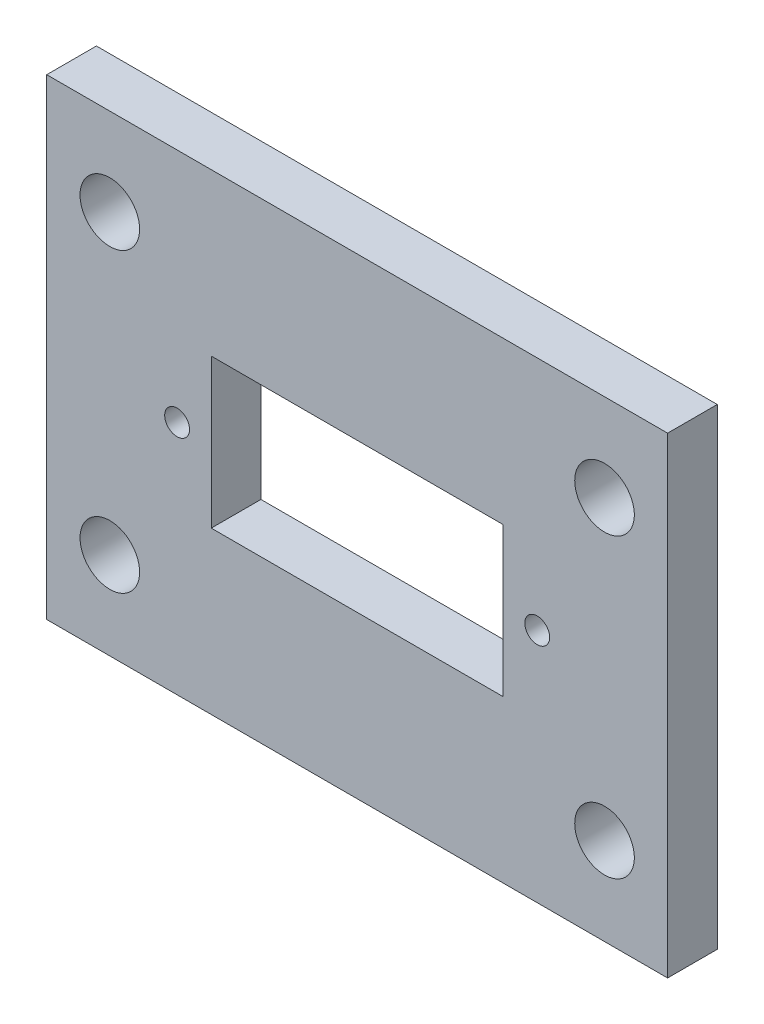
ISO-10303-21;
HEADER;
FILE_DESCRIPTION(('STEP AP214'),'2;1');
FILE_NAME('part.step','',(''),(''),'','','');
FILE_SCHEMA(('AUTOMOTIVE_DESIGN { 1 0 10303 214 1 1 1 1 }'));
ENDSEC;
DATA;
#1=APPLICATION_CONTEXT('core data for automotive mechanical design processes');
#2=APPLICATION_PROTOCOL_DEFINITION('international standard','automotive_design',2000,#1);
#3=PRODUCT_CONTEXT('',#1,'mechanical');
#4=PRODUCT('Part','Part','',(#3));
#5=PRODUCT_RELATED_PRODUCT_CATEGORY('part','',(#4));
#6=PRODUCT_DEFINITION_FORMATION('','',#4);
#7=PRODUCT_DEFINITION_CONTEXT('part definition',#1,'design');
#8=PRODUCT_DEFINITION('design','',#6,#7);
#9=PRODUCT_DEFINITION_SHAPE('','',#8);
#10=(LENGTH_UNIT() NAMED_UNIT(*) SI_UNIT(.MILLI.,.METRE.));
#11=(NAMED_UNIT(*) PLANE_ANGLE_UNIT() SI_UNIT($,.RADIAN.));
#12=(NAMED_UNIT(*) SI_UNIT($,.STERADIAN.) SOLID_ANGLE_UNIT());
#13=UNCERTAINTY_MEASURE_WITH_UNIT(LENGTH_MEASURE(1.E-05),#10,'distance_accuracy_value','');
#14=(GEOMETRIC_REPRESENTATION_CONTEXT(3) GLOBAL_UNCERTAINTY_ASSIGNED_CONTEXT((#13)) GLOBAL_UNIT_ASSIGNED_CONTEXT((#10,
#11,#12)) REPRESENTATION_CONTEXT('',''));
#15=CARTESIAN_POINT('',(0.,0.,0.));
#16=DIRECTION('',(0.,0.,1.));
#17=DIRECTION('',(1.,0.,0.));
#18=AXIS2_PLACEMENT_3D('',#15,#16,#17);
#19=CARTESIAN_POINT('',(0.,0.,4.));
#20=DIRECTION('',(0.,0.,1.));
#21=DIRECTION('',(1.,0.,0.));
#22=AXIS2_PLACEMENT_3D('',#19,#20,#21);
#23=PLANE('',#22);
#24=CARTESIAN_POINT('',(14.5,-19.,4.));
#25=DIRECTION('',(0.,0.,1.));
#26=DIRECTION('',(1.,0.,0.));
#27=AXIS2_PLACEMENT_3D('',#24,#25,#26);
#28=CIRCLE('',#27,1.);
#29=CARTESIAN_POINT('',(15.5,-19.,4.));
#30=VERTEX_POINT('',#29);
#31=EDGE_CURVE('E423',#30,#30,#28,.T.);
#32=ORIENTED_EDGE('',*,*,#31,.F.);
#33=EDGE_LOOP('',(#32));
#34=FACE_BOUND('',#33,.T.);
#35=CARTESIAN_POINT('',(-14.5,-19.,4.));
#36=DIRECTION('',(0.,0.,1.));
#37=DIRECTION('',(1.,0.,0.));
#38=AXIS2_PLACEMENT_3D('',#35,#36,#37);
#39=CIRCLE('',#38,1.);
#40=CARTESIAN_POINT('',(-13.5,-19.,4.));
#41=VERTEX_POINT('',#40);
#42=EDGE_CURVE('E427',#41,#41,#39,.T.);
#43=ORIENTED_EDGE('',*,*,#42,.F.);
#44=EDGE_LOOP('',(#43));
#45=FACE_BOUND('',#44,.T.);
#46=CARTESIAN_POINT('',(19.92,-30.955,4.));
#47=DIRECTION('',(0.,0.,-1.));
#48=DIRECTION('',(-1.,0.,0.));
#49=AXIS2_PLACEMENT_3D('',#46,#47,#48);
#50=CIRCLE('',#49,2.4);
#51=CARTESIAN_POINT('',(17.52,-30.955,4.));
#52=VERTEX_POINT('',#51);
#53=EDGE_CURVE('E437',#52,#52,#50,.T.);
#54=ORIENTED_EDGE('',*,*,#53,.T.);
#55=EDGE_LOOP('',(#54));
#56=FACE_BOUND('',#55,.T.);
#57=CARTESIAN_POINT('',(19.92,-7.045,4.));
#58=DIRECTION('',(0.,0.,-1.));
#59=DIRECTION('',(-1.,0.,0.));
#60=AXIS2_PLACEMENT_3D('',#57,#58,#59);
#61=CIRCLE('',#60,2.4);
#62=CARTESIAN_POINT('',(17.52,-7.045,4.));
#63=VERTEX_POINT('',#62);
#64=EDGE_CURVE('E208',#63,#63,#61,.T.);
#65=ORIENTED_EDGE('',*,*,#64,.T.);
#66=EDGE_LOOP('',(#65));
#67=FACE_BOUND('',#66,.T.);
#68=CARTESIAN_POINT('',(-19.92,-7.045,4.));
#69=DIRECTION('',(0.,0.,1.));
#70=DIRECTION('',(1.,0.,0.));
#71=AXIS2_PLACEMENT_3D('',#68,#69,#70);
#72=CIRCLE('',#71,2.4);
#73=CARTESIAN_POINT('',(-17.52,-7.045,4.));
#74=VERTEX_POINT('',#73);
#75=EDGE_CURVE('E225',#74,#74,#72,.T.);
#76=ORIENTED_EDGE('',*,*,#75,.F.);
#77=EDGE_LOOP('',(#76));
#78=FACE_BOUND('',#77,.T.);
#79=DIRECTION('',(0.,-1.,0.));
#80=VECTOR('',#79,1.);
#81=CARTESIAN_POINT('',(-25.,0.,4.));
#82=LINE('',#81,#80);
#83=CARTESIAN_POINT('',(-25.,0.,4.));
#84=VERTEX_POINT('',#83);
#85=CARTESIAN_POINT('',(-25.,-38.,4.));
#86=VERTEX_POINT('',#85);
#87=EDGE_CURVE('E231',#84,#86,#82,.T.);
#88=ORIENTED_EDGE('',*,*,#87,.T.);
#89=DIRECTION('',(1.,0.,0.));
#90=VECTOR('',#89,1.);
#91=CARTESIAN_POINT('',(-25.,-38.,4.));
#92=LINE('',#91,#90);
#93=CARTESIAN_POINT('',(25.,-38.,4.));
#94=VERTEX_POINT('',#93);
#95=EDGE_CURVE('E234',#86,#94,#92,.T.);
#96=ORIENTED_EDGE('',*,*,#95,.T.);
#97=DIRECTION('',(0.,-1.,0.));
#98=VECTOR('',#97,1.);
#99=CARTESIAN_POINT('',(25.,0.,4.));
#100=LINE('',#99,#98);
#101=CARTESIAN_POINT('',(25.,0.,4.));
#102=VERTEX_POINT('',#101);
#103=EDGE_CURVE('E237',#102,#94,#100,.T.);
#104=ORIENTED_EDGE('',*,*,#103,.F.);
#105=DIRECTION('',(1.,0.,0.));
#106=VECTOR('',#105,1.);
#107=CARTESIAN_POINT('',(-25.,0.,4.));
#108=LINE('',#107,#106);
#109=EDGE_CURVE('E240',#84,#102,#108,.T.);
#110=ORIENTED_EDGE('',*,*,#109,.F.);
#111=EDGE_LOOP('',(#88,#96,#104,#110));
#112=FACE_BOUND('',#111,.T.);
#113=CARTESIAN_POINT('',(-19.92,-30.955,4.));
#114=DIRECTION('',(0.,0.,1.));
#115=DIRECTION('',(1.,0.,0.));
#116=AXIS2_PLACEMENT_3D('',#113,#114,#115);
#117=CIRCLE('',#116,2.4);
#118=CARTESIAN_POINT('',(-17.52,-30.955,4.));
#119=VERTEX_POINT('',#118);
#120=EDGE_CURVE('E219',#119,#119,#117,.T.);
#121=ORIENTED_EDGE('',*,*,#120,.F.);
#122=EDGE_LOOP('',(#121));
#123=FACE_BOUND('',#122,.T.);
#124=DIRECTION('',(1.,0.,0.));
#125=VECTOR('',#124,1.);
#126=CARTESIAN_POINT('',(-11.75,-25.,4.));
#127=LINE('',#126,#125);
#128=CARTESIAN_POINT('',(-11.75,-25.,4.));
#129=VERTEX_POINT('',#128);
#130=CARTESIAN_POINT('',(11.75,-25.,4.));
#131=VERTEX_POINT('',#130);
#132=EDGE_CURVE('E191',#129,#131,#127,.T.);
#133=ORIENTED_EDGE('',*,*,#132,.F.);
#134=DIRECTION('',(0.,-1.,0.));
#135=VECTOR('',#134,1.);
#136=CARTESIAN_POINT('',(-11.75,-13.,4.));
#137=LINE('',#136,#135);
#138=CARTESIAN_POINT('',(-11.75,-13.,4.));
#139=VERTEX_POINT('',#138);
#140=EDGE_CURVE('E182',#139,#129,#137,.T.);
#141=ORIENTED_EDGE('',*,*,#140,.F.);
#142=DIRECTION('',(1.,0.,0.));
#143=VECTOR('',#142,1.);
#144=CARTESIAN_POINT('',(-11.75,-13.,4.));
#145=LINE('',#144,#143);
#146=CARTESIAN_POINT('',(11.75,-13.,4.));
#147=VERTEX_POINT('',#146);
#148=EDGE_CURVE('E202',#139,#147,#145,.T.);
#149=ORIENTED_EDGE('',*,*,#148,.T.);
#150=DIRECTION('',(0.,-1.,0.));
#151=VECTOR('',#150,1.);
#152=CARTESIAN_POINT('',(11.75,-13.,4.));
#153=LINE('',#152,#151);
#154=EDGE_CURVE('E132',#147,#131,#153,.T.);
#155=ORIENTED_EDGE('',*,*,#154,.T.);
#156=EDGE_LOOP('',(#133,#141,#149,#155));
#157=FACE_BOUND('',#156,.T.);
#158=ADVANCED_FACE('F117',(#34,#45,#56,#67,#78,#112,#123,#157),#23,.T.);
#159=CARTESIAN_POINT('',(0.,0.,0.));
#160=DIRECTION('',(0.,0.,1.));
#161=DIRECTION('',(1.,0.,0.));
#162=AXIS2_PLACEMENT_3D('',#159,#160,#161);
#163=PLANE('',#162);
#164=CARTESIAN_POINT('',(14.5,-19.,0.));
#165=DIRECTION('',(0.,0.,1.));
#166=DIRECTION('',(1.,0.,0.));
#167=AXIS2_PLACEMENT_3D('',#164,#165,#166);
#168=CIRCLE('',#167,1.);
#169=CARTESIAN_POINT('',(15.5,-19.,0.));
#170=VERTEX_POINT('',#169);
#171=EDGE_CURVE('E426',#170,#170,#168,.F.);
#172=ORIENTED_EDGE('',*,*,#171,.F.);
#173=EDGE_LOOP('',(#172));
#174=FACE_BOUND('',#173,.T.);
#175=CARTESIAN_POINT('',(-14.5,-19.,0.));
#176=DIRECTION('',(0.,0.,1.));
#177=DIRECTION('',(1.,0.,0.));
#178=AXIS2_PLACEMENT_3D('',#175,#176,#177);
#179=CIRCLE('',#178,1.);
#180=CARTESIAN_POINT('',(-13.5,-19.,0.));
#181=VERTEX_POINT('',#180);
#182=EDGE_CURVE('E430',#181,#181,#179,.F.);
#183=ORIENTED_EDGE('',*,*,#182,.F.);
#184=EDGE_LOOP('',(#183));
#185=FACE_BOUND('',#184,.T.);
#186=CARTESIAN_POINT('',(19.92,-30.955,0.));
#187=DIRECTION('',(0.,0.,-1.));
#188=DIRECTION('',(-1.,0.,0.));
#189=AXIS2_PLACEMENT_3D('',#186,#187,#188);
#190=CIRCLE('',#189,2.4);
#191=CARTESIAN_POINT('',(17.52,-30.955,0.));
#192=VERTEX_POINT('',#191);
#193=EDGE_CURVE('E436',#192,#192,#190,.T.);
#194=ORIENTED_EDGE('',*,*,#193,.F.);
#195=EDGE_LOOP('',(#194));
#196=FACE_BOUND('',#195,.T.);
#197=CARTESIAN_POINT('',(19.92,-7.045,0.));
#198=DIRECTION('',(0.,0.,-1.));
#199=DIRECTION('',(-1.,0.,0.));
#200=AXIS2_PLACEMENT_3D('',#197,#198,#199);
#201=CIRCLE('',#200,2.4);
#202=CARTESIAN_POINT('',(17.52,-7.045,0.));
#203=VERTEX_POINT('',#202);
#204=EDGE_CURVE('E440',#203,#203,#201,.T.);
#205=ORIENTED_EDGE('',*,*,#204,.F.);
#206=EDGE_LOOP('',(#205));
#207=FACE_BOUND('',#206,.T.);
#208=CARTESIAN_POINT('',(-19.92,-30.955,0.));
#209=DIRECTION('',(0.,0.,1.));
#210=DIRECTION('',(1.,0.,0.));
#211=AXIS2_PLACEMENT_3D('',#208,#209,#210);
#212=CIRCLE('',#211,2.4);
#213=CARTESIAN_POINT('',(-17.52,-30.955,0.));
#214=VERTEX_POINT('',#213);
#215=EDGE_CURVE('E198',#214,#214,#212,.T.);
#216=ORIENTED_EDGE('',*,*,#215,.T.);
#217=EDGE_LOOP('',(#216));
#218=FACE_BOUND('',#217,.T.);
#219=CARTESIAN_POINT('',(-19.92,-7.045,0.));
#220=DIRECTION('',(0.,0.,1.));
#221=DIRECTION('',(1.,0.,0.));
#222=AXIS2_PLACEMENT_3D('',#219,#220,#221);
#223=CIRCLE('',#222,2.4);
#224=CARTESIAN_POINT('',(-17.52,-7.045,0.));
#225=VERTEX_POINT('',#224);
#226=EDGE_CURVE('E222',#225,#225,#223,.T.);
#227=ORIENTED_EDGE('',*,*,#226,.T.);
#228=EDGE_LOOP('',(#227));
#229=FACE_BOUND('',#228,.T.);
#230=DIRECTION('',(0.,-1.,0.));
#231=VECTOR('',#230,1.);
#232=CARTESIAN_POINT('',(-25.,0.,0.));
#233=LINE('',#232,#231);
#234=CARTESIAN_POINT('',(-25.,0.,0.));
#235=VERTEX_POINT('',#234);
#236=CARTESIAN_POINT('',(-25.,-38.,0.));
#237=VERTEX_POINT('',#236);
#238=EDGE_CURVE('E228',#235,#237,#233,.T.);
#239=ORIENTED_EDGE('',*,*,#238,.F.);
#240=DIRECTION('',(1.,0.,0.));
#241=VECTOR('',#240,1.);
#242=CARTESIAN_POINT('',(-25.,0.,0.));
#243=LINE('',#242,#241);
#244=CARTESIAN_POINT('',(25.,0.,0.));
#245=VERTEX_POINT('',#244);
#246=EDGE_CURVE('E235',#235,#245,#243,.T.);
#247=ORIENTED_EDGE('',*,*,#246,.T.);
#248=DIRECTION('',(0.,-1.,0.));
#249=VECTOR('',#248,1.);
#250=CARTESIAN_POINT('',(25.,0.,0.));
#251=LINE('',#250,#249);
#252=CARTESIAN_POINT('',(25.,-38.,0.));
#253=VERTEX_POINT('',#252);
#254=EDGE_CURVE('E249',#245,#253,#251,.T.);
#255=ORIENTED_EDGE('',*,*,#254,.T.);
#256=DIRECTION('',(1.,0.,0.));
#257=VECTOR('',#256,1.);
#258=CARTESIAN_POINT('',(-25.,-38.,0.));
#259=LINE('',#258,#257);
#260=EDGE_CURVE('E246',#237,#253,#259,.T.);
#261=ORIENTED_EDGE('',*,*,#260,.F.);
#262=EDGE_LOOP('',(#239,#247,#255,#261));
#263=FACE_BOUND('',#262,.T.);
#264=DIRECTION('',(0.,-1.,0.));
#265=VECTOR('',#264,1.);
#266=CARTESIAN_POINT('',(-11.75,-13.,0.));
#267=LINE('',#266,#265);
#268=CARTESIAN_POINT('',(-11.75,-13.,0.));
#269=VERTEX_POINT('',#268);
#270=CARTESIAN_POINT('',(-11.75,-25.,0.));
#271=VERTEX_POINT('',#270);
#272=EDGE_CURVE('E140',#269,#271,#267,.T.);
#273=ORIENTED_EDGE('',*,*,#272,.T.);
#274=DIRECTION('',(1.,0.,0.));
#275=VECTOR('',#274,1.);
#276=CARTESIAN_POINT('',(-11.75,-25.,0.));
#277=LINE('',#276,#275);
#278=CARTESIAN_POINT('',(11.75,-25.,0.));
#279=VERTEX_POINT('',#278);
#280=EDGE_CURVE('E197',#271,#279,#277,.T.);
#281=ORIENTED_EDGE('',*,*,#280,.T.);
#282=DIRECTION('',(0.,-1.,0.));
#283=VECTOR('',#282,1.);
#284=CARTESIAN_POINT('',(11.75,-13.,0.));
#285=LINE('',#284,#283);
#286=CARTESIAN_POINT('',(11.75,-13.,0.));
#287=VERTEX_POINT('',#286);
#288=EDGE_CURVE('E210',#287,#279,#285,.T.);
#289=ORIENTED_EDGE('',*,*,#288,.F.);
#290=DIRECTION('',(1.,0.,0.));
#291=VECTOR('',#290,1.);
#292=CARTESIAN_POINT('',(-11.75,-13.,0.));
#293=LINE('',#292,#291);
#294=EDGE_CURVE('E192',#269,#287,#293,.T.);
#295=ORIENTED_EDGE('',*,*,#294,.F.);
#296=EDGE_LOOP('',(#273,#281,#289,#295));
#297=FACE_BOUND('',#296,.T.);
#298=ADVANCED_FACE('F266',(#174,#185,#196,#207,#218,#229,#263,#297),#163,.F.);
#299=CARTESIAN_POINT('',(-25.,0.,4.));
#300=DIRECTION('',(1.,0.,0.));
#301=DIRECTION('',(0.,1.,0.));
#302=AXIS2_PLACEMENT_3D('',#299,#300,#301);
#303=PLANE('',#302);
#304=ORIENTED_EDGE('',*,*,#238,.T.);
#305=DIRECTION('',(0.,0.,-1.));
#306=VECTOR('',#305,1.);
#307=CARTESIAN_POINT('',(-25.,-38.,4.));
#308=LINE('',#307,#306);
#309=EDGE_CURVE('E12',#86,#237,#308,.T.);
#310=ORIENTED_EDGE('',*,*,#309,.F.);
#311=ORIENTED_EDGE('',*,*,#87,.F.);
#312=DIRECTION('',(0.,0.,-1.));
#313=VECTOR('',#312,1.);
#314=CARTESIAN_POINT('',(-25.,0.,4.));
#315=LINE('',#314,#313);
#316=EDGE_CURVE('E243',#84,#235,#315,.T.);
#317=ORIENTED_EDGE('',*,*,#316,.T.);
#318=EDGE_LOOP('',(#304,#310,#311,#317));
#319=FACE_BOUND('',#318,.T.);
#320=ADVANCED_FACE('F119',(#319),#303,.F.);
#321=CARTESIAN_POINT('',(-25.,-38.,4.));
#322=DIRECTION('',(0.,1.,0.));
#323=DIRECTION('',(0.,0.,1.));
#324=AXIS2_PLACEMENT_3D('',#321,#322,#323);
#325=PLANE('',#324);
#326=ORIENTED_EDGE('',*,*,#260,.T.);
#327=DIRECTION('',(0.,0.,-1.));
#328=VECTOR('',#327,1.);
#329=CARTESIAN_POINT('',(25.,-38.,4.));
#330=LINE('',#329,#328);
#331=EDGE_CURVE('E125',#94,#253,#330,.T.);
#332=ORIENTED_EDGE('',*,*,#331,.F.);
#333=ORIENTED_EDGE('',*,*,#95,.F.);
#334=ORIENTED_EDGE('',*,*,#309,.T.);
#335=EDGE_LOOP('',(#326,#332,#333,#334));
#336=FACE_BOUND('',#335,.T.);
#337=ADVANCED_FACE('F262',(#336),#325,.F.);
#338=CARTESIAN_POINT('',(25.,0.,4.));
#339=DIRECTION('',(1.,0.,0.));
#340=DIRECTION('',(0.,0.,-1.));
#341=AXIS2_PLACEMENT_3D('',#338,#339,#340);
#342=PLANE('',#341);
#343=ORIENTED_EDGE('',*,*,#254,.F.);
#344=DIRECTION('',(0.,0.,-1.));
#345=VECTOR('',#344,1.);
#346=CARTESIAN_POINT('',(25.,0.,4.));
#347=LINE('',#346,#345);
#348=EDGE_CURVE('E255',#102,#245,#347,.T.);
#349=ORIENTED_EDGE('',*,*,#348,.F.);
#350=ORIENTED_EDGE('',*,*,#103,.T.);
#351=ORIENTED_EDGE('',*,*,#331,.T.);
#352=EDGE_LOOP('',(#343,#349,#350,#351));
#353=FACE_BOUND('',#352,.T.);
#354=ADVANCED_FACE('F259',(#353),#342,.T.);
#355=CARTESIAN_POINT('',(-25.,0.,4.));
#356=DIRECTION('',(0.,1.,0.));
#357=DIRECTION('',(-1.,0.,0.));
#358=AXIS2_PLACEMENT_3D('',#355,#356,#357);
#359=PLANE('',#358);
#360=ORIENTED_EDGE('',*,*,#246,.F.);
#361=ORIENTED_EDGE('',*,*,#316,.F.);
#362=ORIENTED_EDGE('',*,*,#109,.T.);
#363=ORIENTED_EDGE('',*,*,#348,.T.);
#364=EDGE_LOOP('',(#360,#361,#362,#363));
#365=FACE_BOUND('',#364,.T.);
#366=ADVANCED_FACE('F270',(#365),#359,.T.);
#367=CARTESIAN_POINT('',(-19.92,-7.045,4.));
#368=DIRECTION('',(0.,0.,-1.));
#369=DIRECTION('',(-1.,0.,0.));
#370=AXIS2_PLACEMENT_3D('',#367,#368,#369);
#371=CYLINDRICAL_SURFACE('',#370,2.4);
#372=ORIENTED_EDGE('',*,*,#75,.T.);
#373=EDGE_LOOP('',(#372));
#374=FACE_BOUND('',#373,.T.);
#375=ORIENTED_EDGE('',*,*,#226,.F.);
#376=EDGE_LOOP('',(#375));
#377=FACE_BOUND('',#376,.T.);
#378=ADVANCED_FACE('F291',(#374,#377),#371,.F.);
#379=CARTESIAN_POINT('',(-19.92,-30.955,4.));
#380=DIRECTION('',(0.,0.,-1.));
#381=DIRECTION('',(-1.,0.,0.));
#382=AXIS2_PLACEMENT_3D('',#379,#380,#381);
#383=CYLINDRICAL_SURFACE('',#382,2.4);
#384=ORIENTED_EDGE('',*,*,#120,.T.);
#385=EDGE_LOOP('',(#384));
#386=FACE_BOUND('',#385,.T.);
#387=ORIENTED_EDGE('',*,*,#215,.F.);
#388=EDGE_LOOP('',(#387));
#389=FACE_BOUND('',#388,.T.);
#390=ADVANCED_FACE('F311',(#386,#389),#383,.F.);
#391=CARTESIAN_POINT('',(-11.75,-13.,4.));
#392=DIRECTION('',(1.,0.,0.));
#393=DIRECTION('',(0.,1.,0.));
#394=AXIS2_PLACEMENT_3D('',#391,#392,#393);
#395=PLANE('',#394);
#396=ORIENTED_EDGE('',*,*,#272,.F.);
#397=DIRECTION('',(0.,0.,-1.));
#398=VECTOR('',#397,1.);
#399=CARTESIAN_POINT('',(-11.75,-13.,4.));
#400=LINE('',#399,#398);
#401=EDGE_CURVE('E186',#139,#269,#400,.T.);
#402=ORIENTED_EDGE('',*,*,#401,.F.);
#403=ORIENTED_EDGE('',*,*,#140,.T.);
#404=DIRECTION('',(0.,0.,-1.));
#405=VECTOR('',#404,1.);
#406=CARTESIAN_POINT('',(-11.75,-25.,4.));
#407=LINE('',#406,#405);
#408=EDGE_CURVE('E185',#129,#271,#407,.T.);
#409=ORIENTED_EDGE('',*,*,#408,.T.);
#410=EDGE_LOOP('',(#396,#402,#403,#409));
#411=FACE_BOUND('',#410,.T.);
#412=ADVANCED_FACE('F184',(#411),#395,.T.);
#413=CARTESIAN_POINT('',(-11.75,-25.,4.));
#414=DIRECTION('',(0.,1.,0.));
#415=DIRECTION('',(0.,0.,1.));
#416=AXIS2_PLACEMENT_3D('',#413,#414,#415);
#417=PLANE('',#416);
#418=ORIENTED_EDGE('',*,*,#280,.F.);
#419=ORIENTED_EDGE('',*,*,#408,.F.);
#420=ORIENTED_EDGE('',*,*,#132,.T.);
#421=DIRECTION('',(0.,0.,-1.));
#422=VECTOR('',#421,1.);
#423=CARTESIAN_POINT('',(11.75,-25.,4.));
#424=LINE('',#423,#422);
#425=EDGE_CURVE('E199',#131,#279,#424,.T.);
#426=ORIENTED_EDGE('',*,*,#425,.T.);
#427=EDGE_LOOP('',(#418,#419,#420,#426));
#428=FACE_BOUND('',#427,.T.);
#429=ADVANCED_FACE('F195',(#428),#417,.T.);
#430=CARTESIAN_POINT('',(11.75,-13.,4.));
#431=DIRECTION('',(1.,0.,0.));
#432=DIRECTION('',(0.,1.,0.));
#433=AXIS2_PLACEMENT_3D('',#430,#431,#432);
#434=PLANE('',#433);
#435=ORIENTED_EDGE('',*,*,#288,.T.);
#436=ORIENTED_EDGE('',*,*,#425,.F.);
#437=ORIENTED_EDGE('',*,*,#154,.F.);
#438=DIRECTION('',(0.,0.,-1.));
#439=VECTOR('',#438,1.);
#440=CARTESIAN_POINT('',(11.75,-13.,4.));
#441=LINE('',#440,#439);
#442=EDGE_CURVE('E216',#147,#287,#441,.T.);
#443=ORIENTED_EDGE('',*,*,#442,.T.);
#444=EDGE_LOOP('',(#435,#436,#437,#443));
#445=FACE_BOUND('',#444,.T.);
#446=ADVANCED_FACE('F330',(#445),#434,.F.);
#447=CARTESIAN_POINT('',(-11.75,-13.,4.));
#448=DIRECTION('',(0.,1.,0.));
#449=DIRECTION('',(-1.,0.,0.));
#450=AXIS2_PLACEMENT_3D('',#447,#448,#449);
#451=PLANE('',#450);
#452=ORIENTED_EDGE('',*,*,#294,.T.);
#453=ORIENTED_EDGE('',*,*,#442,.F.);
#454=ORIENTED_EDGE('',*,*,#148,.F.);
#455=ORIENTED_EDGE('',*,*,#401,.T.);
#456=EDGE_LOOP('',(#452,#453,#454,#455));
#457=FACE_BOUND('',#456,.T.);
#458=ADVANCED_FACE('F337',(#457),#451,.F.);
#459=CARTESIAN_POINT('',(19.92,-7.045,4.));
#460=DIRECTION('',(0.,0.,-1.));
#461=DIRECTION('',(-1.,0.,0.));
#462=AXIS2_PLACEMENT_3D('',#459,#460,#461);
#463=CYLINDRICAL_SURFACE('',#462,2.4);
#464=ORIENTED_EDGE('',*,*,#64,.F.);
#465=EDGE_LOOP('',(#464));
#466=FACE_BOUND('',#465,.T.);
#467=ORIENTED_EDGE('',*,*,#204,.T.);
#468=EDGE_LOOP('',(#467));
#469=FACE_BOUND('',#468,.T.);
#470=ADVANCED_FACE('F344',(#466,#469),#463,.F.);
#471=CARTESIAN_POINT('',(19.92,-30.955,4.));
#472=DIRECTION('',(0.,0.,-1.));
#473=DIRECTION('',(-1.,0.,0.));
#474=AXIS2_PLACEMENT_3D('',#471,#472,#473);
#475=CYLINDRICAL_SURFACE('',#474,2.4);
#476=ORIENTED_EDGE('',*,*,#53,.F.);
#477=EDGE_LOOP('',(#476));
#478=FACE_BOUND('',#477,.T.);
#479=ORIENTED_EDGE('',*,*,#193,.T.);
#480=EDGE_LOOP('',(#479));
#481=FACE_BOUND('',#480,.T.);
#482=ADVANCED_FACE('F352',(#478,#481),#475,.F.);
#483=CARTESIAN_POINT('',(-14.5,-19.,-0.00100000000000013));
#484=DIRECTION('',(0.,0.,1.));
#485=DIRECTION('',(1.,0.,0.));
#486=AXIS2_PLACEMENT_3D('',#483,#484,#485);
#487=CYLINDRICAL_SURFACE('',#486,1.);
#488=ORIENTED_EDGE('',*,*,#42,.T.);
#489=EDGE_LOOP('',(#488));
#490=FACE_BOUND('',#489,.T.);
#491=ORIENTED_EDGE('',*,*,#182,.T.);
#492=EDGE_LOOP('',(#491));
#493=FACE_BOUND('',#492,.T.);
#494=ADVANCED_FACE('F360',(#490,#493),#487,.F.);
#495=CARTESIAN_POINT('',(14.5,-19.,-0.00100000000000013));
#496=DIRECTION('',(0.,0.,1.));
#497=DIRECTION('',(1.,0.,0.));
#498=AXIS2_PLACEMENT_3D('',#495,#496,#497);
#499=CYLINDRICAL_SURFACE('',#498,1.);
#500=ORIENTED_EDGE('',*,*,#31,.T.);
#501=EDGE_LOOP('',(#500));
#502=FACE_BOUND('',#501,.T.);
#503=ORIENTED_EDGE('',*,*,#171,.T.);
#504=EDGE_LOOP('',(#503));
#505=FACE_BOUND('',#504,.T.);
#506=ADVANCED_FACE('F368',(#502,#505),#499,.F.);
#507=CLOSED_SHELL('',(#158,#298,#320,#337,#354,#366,#378,#390,#412,#429,#446,#458,#470,#482,
#494,#506));
#508=MANIFOLD_SOLID_BREP('B2',#507);
#509=ADVANCED_BREP_SHAPE_REPRESENTATION('',(#18,#508),#14);
#510=SHAPE_DEFINITION_REPRESENTATION(#9,#509);
ENDSEC;
END-ISO-10303-21;
